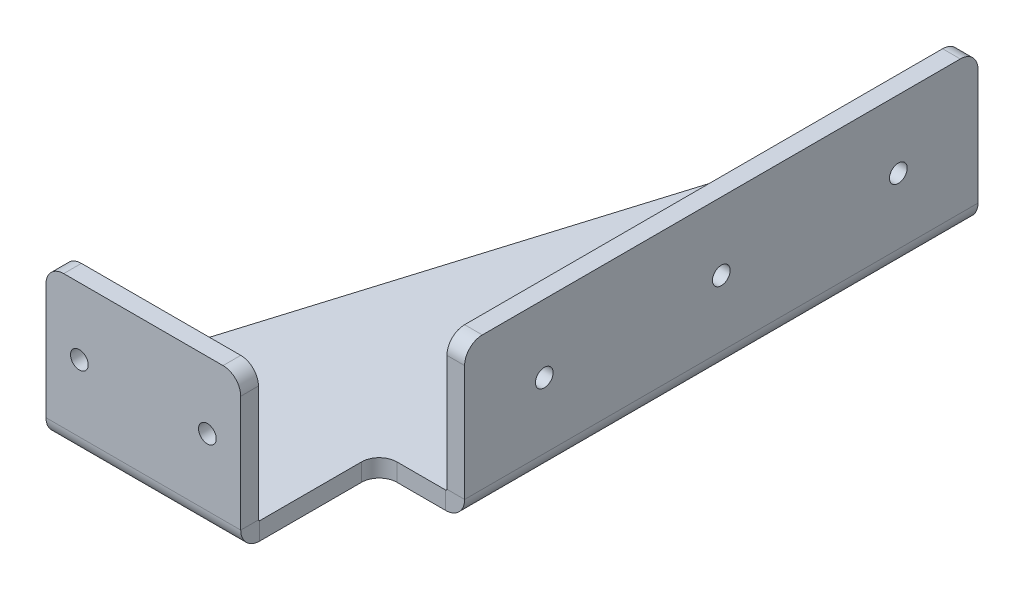
ISO-10303-21;
HEADER;
FILE_DESCRIPTION(('STEP AP214'),'2;1');
FILE_NAME('part.step','',(''),(''),'','','');
FILE_SCHEMA(('AUTOMOTIVE_DESIGN { 1 0 10303 214 1 1 1 1 }'));
ENDSEC;
DATA;
#1=APPLICATION_CONTEXT('core data for automotive mechanical design processes');
#2=APPLICATION_PROTOCOL_DEFINITION('international standard','automotive_design',2000,#1);
#3=PRODUCT_CONTEXT('',#1,'mechanical');
#4=PRODUCT('Part','Part','',(#3));
#5=PRODUCT_RELATED_PRODUCT_CATEGORY('part','',(#4));
#6=PRODUCT_DEFINITION_FORMATION('','',#4);
#7=PRODUCT_DEFINITION_CONTEXT('part definition',#1,'design');
#8=PRODUCT_DEFINITION('design','',#6,#7);
#9=PRODUCT_DEFINITION_SHAPE('','',#8);
#10=(LENGTH_UNIT() NAMED_UNIT(*) SI_UNIT(.MILLI.,.METRE.));
#11=(NAMED_UNIT(*) PLANE_ANGLE_UNIT() SI_UNIT($,.RADIAN.));
#12=(NAMED_UNIT(*) SI_UNIT($,.STERADIAN.) SOLID_ANGLE_UNIT());
#13=UNCERTAINTY_MEASURE_WITH_UNIT(LENGTH_MEASURE(1.E-05),#10,'distance_accuracy_value','');
#14=(GEOMETRIC_REPRESENTATION_CONTEXT(3) GLOBAL_UNCERTAINTY_ASSIGNED_CONTEXT((#13)) GLOBAL_UNIT_ASSIGNED_CONTEXT((#10,
#11,#12)) REPRESENTATION_CONTEXT('',''));
#15=CARTESIAN_POINT('',(0.,0.,0.));
#16=DIRECTION('',(0.,0.,1.));
#17=DIRECTION('',(1.,0.,0.));
#18=AXIS2_PLACEMENT_3D('',#15,#16,#17);
#19=CARTESIAN_POINT('',(0.,-10.,0.));
#20=DIRECTION('',(0.,1.,0.));
#21=DIRECTION('',(0.,0.,1.));
#22=AXIS2_PLACEMENT_3D('',#19,#20,#21);
#23=PLANE('',#22);
#24=DIRECTION('',(-0.29141369364462,0.,0.95659712478995));
#25=VECTOR('',#24,1.);
#26=CARTESIAN_POINT('',(-18.0000000000001,-10.,-310.907216494845));
#27=LINE('',#26,#25);
#28=CARTESIAN_POINT('',(-20.158607290884,-10.,-303.821353431292));
#29=VERTEX_POINT('',#28);
#30=CARTESIAN_POINT('',(-110.,-10.,-8.90721649484535));
#31=VERTEX_POINT('',#30);
#32=EDGE_CURVE('E281',#29,#31,#27,.T.);
#33=ORIENTED_EDGE('',*,*,#32,.F.);
#34=CARTESIAN_POINT('',(-10.5926360429845,-10.,-300.907216494845));
#35=DIRECTION('',(0.,1.,0.));
#36=DIRECTION('',(0.,0.,1.));
#37=AXIS2_PLACEMENT_3D('',#34,#35,#36);
#38=CIRCLE('',#37,10.);
#39=CARTESIAN_POINT('',(-10.5926360429845,-10.,-310.907216494845));
#40=VERTEX_POINT('',#39);
#41=EDGE_CURVE('E371',#29,#40,#38,.F.);
#42=ORIENTED_EDGE('',*,*,#41,.T.);
#43=DIRECTION('',(-1.,0.,0.));
#44=VECTOR('',#43,1.);
#45=CARTESIAN_POINT('',(122.,-10.,-310.907216494845));
#46=LINE('',#45,#44);
#47=CARTESIAN_POINT('',(37.4944848958541,-10.,-310.907216494845));
#48=VERTEX_POINT('',#47);
#49=EDGE_CURVE('E284',#48,#40,#46,.T.);
#50=ORIENTED_EDGE('',*,*,#49,.F.);
#51=DIRECTION('',(0.,0.,1.));
#52=VECTOR('',#51,1.);
#53=CARTESIAN_POINT('',(37.4944848958541,-10.,0.));
#54=LINE('',#53,#52);
#55=CARTESIAN_POINT('',(37.4944848958541,-10.,-20.9072164948453));
#56=VERTEX_POINT('',#55);
#57=EDGE_CURVE('E231',#48,#56,#54,.T.);
#58=ORIENTED_EDGE('',*,*,#57,.T.);
#59=DIRECTION('',(1.,0.,0.));
#60=VECTOR('',#59,1.);
#61=CARTESIAN_POINT('',(0.,-10.,-20.9072164948453));
#62=LINE('',#61,#60);
#63=CARTESIAN_POINT('',(10.,-10.,-20.9072164948453));
#64=VERTEX_POINT('',#63);
#65=EDGE_CURVE('E312',#64,#56,#62,.T.);
#66=ORIENTED_EDGE('',*,*,#65,.F.);
#67=CARTESIAN_POINT('',(10.,-10.,-10.9072164948453));
#68=DIRECTION('',(0.,1.,0.));
#69=DIRECTION('',(0.,0.,1.));
#70=AXIS2_PLACEMENT_3D('',#67,#68,#69);
#71=CIRCLE('',#70,10.);
#72=CARTESIAN_POINT('',(0.,-10.,-10.9072164948453));
#73=VERTEX_POINT('',#72);
#74=EDGE_CURVE('E12',#64,#73,#71,.T.);
#75=ORIENTED_EDGE('',*,*,#74,.T.);
#76=DIRECTION('',(0.,0.,-1.));
#77=VECTOR('',#76,1.);
#78=CARTESIAN_POINT('',(0.,-10.,131.092783505155));
#79=LINE('',#78,#77);
#80=CARTESIAN_POINT('',(0.,-10.,46.5872684010088));
#81=VERTEX_POINT('',#80);
#82=EDGE_CURVE('E306',#81,#73,#79,.T.);
#83=ORIENTED_EDGE('',*,*,#82,.F.);
#84=DIRECTION('',(-1.,0.,0.));
#85=VECTOR('',#84,1.);
#86=CARTESIAN_POINT('',(0.,-10.,46.5872684010088));
#87=LINE('',#86,#85);
#88=CARTESIAN_POINT('',(-110.,-10.,46.5872684010088));
#89=VERTEX_POINT('',#88);
#90=EDGE_CURVE('E292',#81,#89,#87,.T.);
#91=ORIENTED_EDGE('',*,*,#90,.T.);
#92=DIRECTION('',(0.,0.,1.));
#93=VECTOR('',#92,1.);
#94=CARTESIAN_POINT('',(-110.,-10.,-8.90721649484535));
#95=LINE('',#94,#93);
#96=EDGE_CURVE('E283',#31,#89,#95,.T.);
#97=ORIENTED_EDGE('',*,*,#96,.F.);
#98=EDGE_LOOP('',(#33,#42,#50,#58,#66,#75,#83,#91,#97));
#99=FACE_BOUND('',#98,.T.);
#100=ADVANCED_FACE('F50',(#99),#23,.F.);
#101=CARTESIAN_POINT('',(-110.,-10.,-8.90721649484535));
#102=DIRECTION('',(-1.,0.,0.));
#103=DIRECTION('',(0.,0.,1.));
#104=AXIS2_PLACEMENT_3D('',#101,#102,#103);
#105=PLANE('',#104);
#106=DIRECTION('',(0.,-1.,0.));
#107=VECTOR('',#106,1.);
#108=CARTESIAN_POINT('',(-110.,-10.,46.5872684010088));
#109=LINE('',#108,#107);
#110=CARTESIAN_POINT('',(-110.,0.,46.5872684010088));
#111=VERTEX_POINT('',#110);
#112=EDGE_CURVE('E301',#111,#89,#109,.T.);
#113=ORIENTED_EDGE('',*,*,#112,.F.);
#114=DIRECTION('',(0.,0.,1.));
#115=VECTOR('',#114,1.);
#116=CARTESIAN_POINT('',(-110.,0.,-8.90721649484535));
#117=LINE('',#116,#115);
#118=CARTESIAN_POINT('',(-110.,0.,-8.90721649484535));
#119=VERTEX_POINT('',#118);
#120=EDGE_CURVE('E287',#119,#111,#117,.T.);
#121=ORIENTED_EDGE('',*,*,#120,.F.);
#122=DIRECTION('',(0.,1.,0.));
#123=VECTOR('',#122,1.);
#124=CARTESIAN_POINT('',(-110.,-10.,-8.90721649484535));
#125=LINE('',#124,#123);
#126=EDGE_CURVE('E289',#31,#119,#125,.T.);
#127=ORIENTED_EDGE('',*,*,#126,.F.);
#128=ORIENTED_EDGE('',*,*,#96,.T.);
#129=EDGE_LOOP('',(#113,#121,#127,#128));
#130=FACE_BOUND('',#129,.T.);
#131=ADVANCED_FACE('F407',(#130),#105,.T.);
#132=CARTESIAN_POINT('',(-18.0000000000001,-10.,-310.907216494845));
#133=DIRECTION('',(-0.95659712478995,0.,-0.29141369364462));
#134=DIRECTION('',(-0.29141369364462,0.,0.95659712478995));
#135=AXIS2_PLACEMENT_3D('',#132,#133,#134);
#136=PLANE('',#135);
#137=DIRECTION('',(-0.29141369364462,0.,0.95659712478995));
#138=VECTOR('',#137,1.);
#139=CARTESIAN_POINT('',(-18.0000000000001,0.,-310.907216494845));
#140=LINE('',#139,#138);
#141=CARTESIAN_POINT('',(-20.158607290884,0.,-303.821353431292));
#142=VERTEX_POINT('',#141);
#143=EDGE_CURVE('E285',#142,#119,#140,.T.);
#144=ORIENTED_EDGE('',*,*,#143,.F.);
#145=DIRECTION('',(0.,1.,0.));
#146=VECTOR('',#145,1.);
#147=CARTESIAN_POINT('',(-20.158607290884,-10.,-303.821353431292));
#148=LINE('',#147,#146);
#149=EDGE_CURVE('E65',#142,#29,#148,.F.);
#150=ORIENTED_EDGE('',*,*,#149,.T.);
#151=ORIENTED_EDGE('',*,*,#32,.T.);
#152=ORIENTED_EDGE('',*,*,#126,.T.);
#153=EDGE_LOOP('',(#144,#150,#151,#152));
#154=FACE_BOUND('',#153,.T.);
#155=ADVANCED_FACE('F409',(#154),#136,.T.);
#156=CARTESIAN_POINT('',(122.,-10.,-310.907216494845));
#157=DIRECTION('',(0.,0.,-1.));
#158=DIRECTION('',(-1.,0.,0.));
#159=AXIS2_PLACEMENT_3D('',#156,#157,#158);
#160=PLANE('',#159);
#161=ORIENTED_EDGE('',*,*,#49,.T.);
#162=DIRECTION('',(0.,1.,0.));
#163=VECTOR('',#162,1.);
#164=CARTESIAN_POINT('',(-10.5926360429845,-10.,-310.907216494845));
#165=LINE('',#164,#163);
#166=CARTESIAN_POINT('',(-10.5926360429845,0.,-310.907216494845));
#167=VERTEX_POINT('',#166);
#168=EDGE_CURVE('E366',#40,#167,#165,.T.);
#169=ORIENTED_EDGE('',*,*,#168,.T.);
#170=DIRECTION('',(-1.,0.,0.));
#171=VECTOR('',#170,1.);
#172=CARTESIAN_POINT('',(122.,0.,-310.907216494845));
#173=LINE('',#172,#171);
#174=CARTESIAN_POINT('',(37.4944848958541,0.,-310.907216494845));
#175=VERTEX_POINT('',#174);
#176=EDGE_CURVE('E288',#175,#167,#173,.T.);
#177=ORIENTED_EDGE('',*,*,#176,.F.);
#178=DIRECTION('',(0.,1.,0.));
#179=VECTOR('',#178,1.);
#180=CARTESIAN_POINT('',(37.4944848958541,-10.,-310.907216494845));
#181=LINE('',#180,#179);
#182=EDGE_CURVE('E314',#48,#175,#181,.T.);
#183=ORIENTED_EDGE('',*,*,#182,.F.);
#184=EDGE_LOOP('',(#161,#169,#177,#183));
#185=FACE_BOUND('',#184,.T.);
#186=ADVANCED_FACE('F415',(#185),#160,.T.);
#187=CARTESIAN_POINT('',(0.,-10.,-20.9072164948453));
#188=DIRECTION('',(0.,0.,1.));
#189=DIRECTION('',(1.,0.,0.));
#190=AXIS2_PLACEMENT_3D('',#187,#188,#189);
#191=PLANE('',#190);
#192=DIRECTION('',(1.,0.,0.));
#193=VECTOR('',#192,1.);
#194=CARTESIAN_POINT('',(0.,0.,-20.9072164948453));
#195=LINE('',#194,#193);
#196=CARTESIAN_POINT('',(10.,0.,-20.9072164948453));
#197=VERTEX_POINT('',#196);
#198=CARTESIAN_POINT('',(37.4944848958541,0.,-20.9072164948453));
#199=VERTEX_POINT('',#198);
#200=EDGE_CURVE('E309',#197,#199,#195,.T.);
#201=ORIENTED_EDGE('',*,*,#200,.F.);
#202=DIRECTION('',(0.,1.,0.));
#203=VECTOR('',#202,1.);
#204=CARTESIAN_POINT('',(10.,-10.,-20.9072164948453));
#205=LINE('',#204,#203);
#206=EDGE_CURVE('E348',#197,#64,#205,.F.);
#207=ORIENTED_EDGE('',*,*,#206,.T.);
#208=ORIENTED_EDGE('',*,*,#65,.T.);
#209=DIRECTION('',(0.,-1.,0.));
#210=VECTOR('',#209,1.);
#211=CARTESIAN_POINT('',(37.4944848958541,-10.,-20.9072164948453));
#212=LINE('',#211,#210);
#213=EDGE_CURVE('E319',#199,#56,#212,.T.);
#214=ORIENTED_EDGE('',*,*,#213,.F.);
#215=EDGE_LOOP('',(#201,#207,#208,#214));
#216=FACE_BOUND('',#215,.T.);
#217=ADVANCED_FACE('F382',(#216),#191,.T.);
#218=CARTESIAN_POINT('',(0.,-10.,131.092783505155));
#219=DIRECTION('',(1.,0.,0.));
#220=DIRECTION('',(0.,0.,-1.));
#221=AXIS2_PLACEMENT_3D('',#218,#219,#220);
#222=PLANE('',#221);
#223=ORIENTED_EDGE('',*,*,#82,.T.);
#224=DIRECTION('',(0.,1.,0.));
#225=VECTOR('',#224,1.);
#226=CARTESIAN_POINT('',(0.,0.,-10.9072164948453));
#227=LINE('',#226,#225);
#228=CARTESIAN_POINT('',(0.,0.,-10.9072164948453));
#229=VERTEX_POINT('',#228);
#230=EDGE_CURVE('E345',#73,#229,#227,.T.);
#231=ORIENTED_EDGE('',*,*,#230,.T.);
#232=DIRECTION('',(0.,0.,-1.));
#233=VECTOR('',#232,1.);
#234=CARTESIAN_POINT('',(0.,0.,131.092783505155));
#235=LINE('',#234,#233);
#236=CARTESIAN_POINT('',(0.,0.,46.5872684010088));
#237=VERTEX_POINT('',#236);
#238=EDGE_CURVE('E276',#237,#229,#235,.T.);
#239=ORIENTED_EDGE('',*,*,#238,.F.);
#240=DIRECTION('',(0.,1.,0.));
#241=VECTOR('',#240,1.);
#242=CARTESIAN_POINT('',(0.,-10.,46.5872684010088));
#243=LINE('',#242,#241);
#244=EDGE_CURVE('E295',#81,#237,#243,.T.);
#245=ORIENTED_EDGE('',*,*,#244,.F.);
#246=EDGE_LOOP('',(#223,#231,#239,#245));
#247=FACE_BOUND('',#246,.T.);
#248=ADVANCED_FACE('F389',(#247),#222,.T.);
#249=CARTESIAN_POINT('',(0.,0.,0.));
#250=DIRECTION('',(0.,1.,0.));
#251=DIRECTION('',(0.,0.,1.));
#252=AXIS2_PLACEMENT_3D('',#249,#250,#251);
#253=PLANE('',#252);
#254=ORIENTED_EDGE('',*,*,#176,.T.);
#255=CARTESIAN_POINT('',(-10.5926360429845,0.,-300.907216494845));
#256=DIRECTION('',(0.,1.,0.));
#257=DIRECTION('',(0.,0.,1.));
#258=AXIS2_PLACEMENT_3D('',#255,#256,#257);
#259=CIRCLE('',#258,10.);
#260=EDGE_CURVE('E73',#167,#142,#259,.T.);
#261=ORIENTED_EDGE('',*,*,#260,.T.);
#262=ORIENTED_EDGE('',*,*,#143,.T.);
#263=ORIENTED_EDGE('',*,*,#120,.T.);
#264=DIRECTION('',(-1.,0.,0.));
#265=VECTOR('',#264,1.);
#266=CARTESIAN_POINT('',(0.,0.,46.5872684010088));
#267=LINE('',#266,#265);
#268=EDGE_CURVE('E298',#237,#111,#267,.T.);
#269=ORIENTED_EDGE('',*,*,#268,.F.);
#270=ORIENTED_EDGE('',*,*,#238,.T.);
#271=CARTESIAN_POINT('',(10.,0.,-10.9072164948453));
#272=DIRECTION('',(0.,1.,0.));
#273=DIRECTION('',(0.,0.,1.));
#274=AXIS2_PLACEMENT_3D('',#271,#272,#273);
#275=CIRCLE('',#274,10.);
#276=EDGE_CURVE('E58',#229,#197,#275,.F.);
#277=ORIENTED_EDGE('',*,*,#276,.T.);
#278=ORIENTED_EDGE('',*,*,#200,.T.);
#279=DIRECTION('',(0.,0.,1.));
#280=VECTOR('',#279,1.);
#281=CARTESIAN_POINT('',(37.4944848958541,0.,0.));
#282=LINE('',#281,#280);
#283=EDGE_CURVE('E316',#175,#199,#282,.T.);
#284=ORIENTED_EDGE('',*,*,#283,.F.);
#285=EDGE_LOOP('',(#254,#261,#262,#263,#269,#270,#277,#278,#284));
#286=FACE_BOUND('',#285,.T.);
#287=ADVANCED_FACE('F374',(#286),#253,.T.);
#288=CARTESIAN_POINT('',(0.,0.7366,46.5872684010088));
#289=DIRECTION('',(1.,0.,0.));
#290=DIRECTION('',(0.,0.,-1.));
#291=AXIS2_PLACEMENT_3D('',#288,#289,#290);
#292=PLANE('',#291);
#293=ORIENTED_EDGE('',*,*,#244,.T.);
#294=CARTESIAN_POINT('',(0.,0.7366,46.5872684010088));
#295=DIRECTION('',(-1.,0.,0.));
#296=DIRECTION('',(0.,0.,1.));
#297=AXIS2_PLACEMENT_3D('',#294,#295,#296);
#298=CIRCLE('',#297,0.7366);
#299=CARTESIAN_POINT('',(0.,0.736600000000004,47.3238684010088));
#300=VERTEX_POINT('',#299);
#301=EDGE_CURVE('E245',#237,#300,#298,.T.);
#302=ORIENTED_EDGE('',*,*,#301,.T.);
#303=DIRECTION('',(0.,0.,-1.));
#304=VECTOR('',#303,1.);
#305=CARTESIAN_POINT('',(0.,0.736600000000039,57.3238684010088));
#306=LINE('',#305,#304);
#307=CARTESIAN_POINT('',(0.,0.736600000000039,57.3238684010088));
#308=VERTEX_POINT('',#307);
#309=EDGE_CURVE('E259',#308,#300,#306,.T.);
#310=ORIENTED_EDGE('',*,*,#309,.F.);
#311=CARTESIAN_POINT('',(0.,0.7366,46.5872684010088));
#312=DIRECTION('',(-1.,0.,0.));
#313=DIRECTION('',(0.,0.,-1.));
#314=AXIS2_PLACEMENT_3D('',#311,#312,#313);
#315=CIRCLE('',#314,10.7366);
#316=EDGE_CURVE('E269',#81,#308,#315,.T.);
#317=ORIENTED_EDGE('',*,*,#316,.F.);
#318=EDGE_LOOP('',(#293,#302,#310,#317));
#319=FACE_BOUND('',#318,.T.);
#320=ADVANCED_FACE('F395',(#319),#292,.T.);
#321=CARTESIAN_POINT('',(-110.,0.7366,46.5872684010088));
#322=DIRECTION('',(-1.,0.,0.));
#323=DIRECTION('',(0.,0.,1.));
#324=AXIS2_PLACEMENT_3D('',#321,#322,#323);
#325=PLANE('',#324);
#326=DIRECTION('',(0.,0.,1.));
#327=VECTOR('',#326,1.);
#328=CARTESIAN_POINT('',(-110.,0.736600000000039,57.3238684010088));
#329=LINE('',#328,#327);
#330=CARTESIAN_POINT('',(-110.,0.736600000000004,47.3238684010088));
#331=VERTEX_POINT('',#330);
#332=CARTESIAN_POINT('',(-110.,0.736600000000025,57.3238684010088));
#333=VERTEX_POINT('',#332);
#334=EDGE_CURVE('E246',#331,#333,#329,.T.);
#335=ORIENTED_EDGE('',*,*,#334,.F.);
#336=CARTESIAN_POINT('',(-110.,0.7366,46.5872684010088));
#337=DIRECTION('',(-1.,0.,0.));
#338=DIRECTION('',(0.,0.,1.));
#339=AXIS2_PLACEMENT_3D('',#336,#337,#338);
#340=CIRCLE('',#339,0.7366);
#341=EDGE_CURVE('E273',#331,#111,#340,.F.);
#342=ORIENTED_EDGE('',*,*,#341,.T.);
#343=ORIENTED_EDGE('',*,*,#112,.T.);
#344=CARTESIAN_POINT('',(-110.,0.7366,46.5872684010088));
#345=DIRECTION('',(1.,0.,0.));
#346=DIRECTION('',(0.,0.,1.));
#347=AXIS2_PLACEMENT_3D('',#344,#345,#346);
#348=CIRCLE('',#347,10.7366);
#349=EDGE_CURVE('E272',#333,#89,#348,.T.);
#350=ORIENTED_EDGE('',*,*,#349,.F.);
#351=EDGE_LOOP('',(#335,#342,#343,#350));
#352=FACE_BOUND('',#351,.T.);
#353=ADVANCED_FACE('F403',(#352),#325,.T.);
#354=CARTESIAN_POINT('',(55.8205696854819,0.7366,46.5872684010088));
#355=DIRECTION('',(-1.,0.,0.));
#356=DIRECTION('',(0.,0.,1.));
#357=AXIS2_PLACEMENT_3D('',#354,#355,#356);
#358=CYLINDRICAL_SURFACE('',#357,10.7366);
#359=ORIENTED_EDGE('',*,*,#349,.T.);
#360=ORIENTED_EDGE('',*,*,#90,.F.);
#361=ORIENTED_EDGE('',*,*,#316,.T.);
#362=DIRECTION('',(-1.,0.,0.));
#363=VECTOR('',#362,1.);
#364=CARTESIAN_POINT('',(0.,0.736600000000046,57.3238684010088));
#365=LINE('',#364,#363);
#366=EDGE_CURVE('E235',#308,#333,#365,.T.);
#367=ORIENTED_EDGE('',*,*,#366,.T.);
#368=EDGE_LOOP('',(#359,#360,#361,#367));
#369=FACE_BOUND('',#368,.T.);
#370=ADVANCED_FACE('F397',(#369),#358,.T.);
#371=CARTESIAN_POINT('',(55.8205696854819,0.7366,46.5872684010088));
#372=DIRECTION('',(-1.,0.,0.));
#373=DIRECTION('',(0.,0.,1.));
#374=AXIS2_PLACEMENT_3D('',#371,#372,#373);
#375=CYLINDRICAL_SURFACE('',#374,0.7366);
#376=ORIENTED_EDGE('',*,*,#341,.F.);
#377=DIRECTION('',(-1.,0.,0.));
#378=VECTOR('',#377,1.);
#379=CARTESIAN_POINT('',(0.,0.736600000000011,47.3238684010088));
#380=LINE('',#379,#378);
#381=EDGE_CURVE('E254',#300,#331,#380,.T.);
#382=ORIENTED_EDGE('',*,*,#381,.F.);
#383=ORIENTED_EDGE('',*,*,#301,.F.);
#384=ORIENTED_EDGE('',*,*,#268,.T.);
#385=EDGE_LOOP('',(#376,#382,#383,#384));
#386=FACE_BOUND('',#385,.T.);
#387=ADVANCED_FACE('F509',(#386),#375,.F.);
#388=CARTESIAN_POINT('',(-110.,76.2310848958542,57.3238684010086));
#389=DIRECTION('',(0.,1.,0.));
#390=DIRECTION('',(1.,0.,0.));
#391=AXIS2_PLACEMENT_3D('',#388,#389,#390);
#392=PLANE('',#391);
#393=DIRECTION('',(1.,0.,0.));
#394=VECTOR('',#393,1.);
#395=CARTESIAN_POINT('',(-110.,76.2310848958542,47.3238684010086));
#396=LINE('',#395,#394);
#397=CARTESIAN_POINT('',(-100.,76.2310848958542,47.3238684010086));
#398=VERTEX_POINT('',#397);
#399=CARTESIAN_POINT('',(-9.99999999999999,76.2310848958542,47.3238684010086));
#400=VERTEX_POINT('',#399);
#401=EDGE_CURVE('E248',#398,#400,#396,.T.);
#402=ORIENTED_EDGE('',*,*,#401,.F.);
#403=DIRECTION('',(0.,0.,-1.));
#404=VECTOR('',#403,1.);
#405=CARTESIAN_POINT('',(-100.,76.2310848958542,57.3238684010086));
#406=LINE('',#405,#404);
#407=CARTESIAN_POINT('',(-100.,76.2310848958542,57.3238684010086));
#408=VERTEX_POINT('',#407);
#409=EDGE_CURVE('E337',#398,#408,#406,.F.);
#410=ORIENTED_EDGE('',*,*,#409,.T.);
#411=DIRECTION('',(1.,0.,0.));
#412=VECTOR('',#411,1.);
#413=CARTESIAN_POINT('',(-110.,76.2310848958542,57.3238684010086));
#414=LINE('',#413,#412);
#415=CARTESIAN_POINT('',(-9.99999999999999,76.2310848958542,57.3238684010086));
#416=VERTEX_POINT('',#415);
#417=EDGE_CURVE('E264',#408,#416,#414,.T.);
#418=ORIENTED_EDGE('',*,*,#417,.T.);
#419=DIRECTION('',(0.,0.,-1.));
#420=VECTOR('',#419,1.);
#421=CARTESIAN_POINT('',(-9.99999999999999,76.2310848958542,57.3238684010086));
#422=LINE('',#421,#420);
#423=EDGE_CURVE('E334',#416,#400,#422,.T.);
#424=ORIENTED_EDGE('',*,*,#423,.T.);
#425=EDGE_LOOP('',(#402,#410,#418,#424));
#426=FACE_BOUND('',#425,.T.);
#427=ADVANCED_FACE('F496',(#426),#392,.T.);
#428=CARTESIAN_POINT('',(0.,-54.8616986093004,57.323868401009));
#429=DIRECTION('',(0.,0.,-1.));
#430=DIRECTION('',(0.,1.,0.));
#431=AXIS2_PLACEMENT_3D('',#428,#429,#430);
#432=PLANE('',#431);
#433=CARTESIAN_POINT('',(-18.841531010084,38.4838424479271,57.323868401009));
#434=DIRECTION('',(0.,0.,-1.));
#435=DIRECTION('',(0.,1.,0.));
#436=AXIS2_PLACEMENT_3D('',#433,#434,#435);
#437=CIRCLE('',#436,4.99999999999999);
#438=CARTESIAN_POINT('',(-18.841531010084,43.4838424479271,57.3238684010089));
#439=VERTEX_POINT('',#438);
#440=EDGE_CURVE('E468',#439,#439,#437,.T.);
#441=ORIENTED_EDGE('',*,*,#440,.T.);
#442=EDGE_LOOP('',(#441));
#443=FACE_BOUND('',#442,.T.);
#444=CARTESIAN_POINT('',(-91.158468989916,38.4838424479271,57.323868401009));
#445=DIRECTION('',(0.,0.,-1.));
#446=DIRECTION('',(0.,1.,0.));
#447=AXIS2_PLACEMENT_3D('',#444,#445,#446);
#448=CIRCLE('',#447,4.99999999999999);
#449=CARTESIAN_POINT('',(-91.158468989916,43.4838424479271,57.3238684010089));
#450=VERTEX_POINT('',#449);
#451=EDGE_CURVE('E462',#450,#450,#448,.T.);
#452=ORIENTED_EDGE('',*,*,#451,.T.);
#453=EDGE_LOOP('',(#452));
#454=FACE_BOUND('',#453,.T.);
#455=ORIENTED_EDGE('',*,*,#417,.F.);
#456=CARTESIAN_POINT('',(-100.,66.2310848958542,57.3238684010086));
#457=DIRECTION('',(0.,0.,-1.));
#458=DIRECTION('',(0.,1.,0.));
#459=AXIS2_PLACEMENT_3D('',#456,#457,#458);
#460=CIRCLE('',#459,10.);
#461=CARTESIAN_POINT('',(-110.,66.2310848958542,57.3238684010086));
#462=VERTEX_POINT('',#461);
#463=EDGE_CURVE('E341',#408,#462,#460,.F.);
#464=ORIENTED_EDGE('',*,*,#463,.T.);
#465=DIRECTION('',(0.,1.,0.));
#466=VECTOR('',#465,1.);
#467=CARTESIAN_POINT('',(-110.,-63.7689151041458,57.3238684010091));
#468=LINE('',#467,#466);
#469=EDGE_CURVE('E242',#333,#462,#468,.T.);
#470=ORIENTED_EDGE('',*,*,#469,.F.);
#471=ORIENTED_EDGE('',*,*,#366,.F.);
#472=DIRECTION('',(0.,-1.,0.));
#473=VECTOR('',#472,1.);
#474=CARTESIAN_POINT('',(0.,76.2310848958542,57.3238684010086));
#475=LINE('',#474,#473);
#476=CARTESIAN_POINT('',(0.,66.2310848958542,57.3238684010086));
#477=VERTEX_POINT('',#476);
#478=EDGE_CURVE('E262',#477,#308,#475,.T.);
#479=ORIENTED_EDGE('',*,*,#478,.F.);
#480=CARTESIAN_POINT('',(-9.99999999999999,66.2310848958542,57.3238684010086));
#481=DIRECTION('',(0.,0.,-1.));
#482=DIRECTION('',(0.,1.,0.));
#483=AXIS2_PLACEMENT_3D('',#480,#481,#482);
#484=CIRCLE('',#483,10.);
#485=EDGE_CURVE('E339',#477,#416,#484,.F.);
#486=ORIENTED_EDGE('',*,*,#485,.T.);
#487=EDGE_LOOP('',(#455,#464,#470,#471,#479,#486));
#488=FACE_BOUND('',#487,.T.);
#489=ADVANCED_FACE('F499',(#443,#454,#488),#432,.F.);
#490=CARTESIAN_POINT('',(0.,76.2310848958542,57.3238684010086));
#491=DIRECTION('',(1.,0.,0.));
#492=DIRECTION('',(0.,-1.,0.));
#493=AXIS2_PLACEMENT_3D('',#490,#491,#492);
#494=PLANE('',#493);
#495=DIRECTION('',(0.,-1.,0.));
#496=VECTOR('',#495,1.);
#497=CARTESIAN_POINT('',(0.,76.2310848958542,47.3238684010086));
#498=LINE('',#497,#496);
#499=CARTESIAN_POINT('',(0.,66.2310848958542,47.3238684010086));
#500=VERTEX_POINT('',#499);
#501=EDGE_CURVE('E257',#500,#300,#498,.T.);
#502=ORIENTED_EDGE('',*,*,#501,.F.);
#503=DIRECTION('',(0.,0.,-1.));
#504=VECTOR('',#503,1.);
#505=CARTESIAN_POINT('',(0.,66.2310848958542,57.3238684010086));
#506=LINE('',#505,#504);
#507=EDGE_CURVE('E343',#500,#477,#506,.F.);
#508=ORIENTED_EDGE('',*,*,#507,.T.);
#509=ORIENTED_EDGE('',*,*,#478,.T.);
#510=ORIENTED_EDGE('',*,*,#309,.T.);
#511=EDGE_LOOP('',(#502,#508,#509,#510));
#512=FACE_BOUND('',#511,.T.);
#513=ADVANCED_FACE('F481',(#512),#494,.T.);
#514=CARTESIAN_POINT('',(0.,-54.8616986093005,47.323868401009));
#515=DIRECTION('',(0.,0.,-1.));
#516=DIRECTION('',(0.,1.,0.));
#517=AXIS2_PLACEMENT_3D('',#514,#515,#516);
#518=PLANE('',#517);
#519=CARTESIAN_POINT('',(-18.841531010084,38.4838424479271,47.3238684010087));
#520=DIRECTION('',(0.,0.,-1.));
#521=DIRECTION('',(0.,1.,0.));
#522=AXIS2_PLACEMENT_3D('',#519,#520,#521);
#523=CIRCLE('',#522,4.99999999999999);
#524=CARTESIAN_POINT('',(-18.841531010084,43.4838424479271,47.3238684010087));
#525=VERTEX_POINT('',#524);
#526=EDGE_CURVE('E471',#525,#525,#523,.T.);
#527=ORIENTED_EDGE('',*,*,#526,.F.);
#528=EDGE_LOOP('',(#527));
#529=FACE_BOUND('',#528,.T.);
#530=CARTESIAN_POINT('',(-91.158468989916,38.4838424479271,47.3238684010087));
#531=DIRECTION('',(0.,0.,-1.));
#532=DIRECTION('',(0.,1.,0.));
#533=AXIS2_PLACEMENT_3D('',#530,#531,#532);
#534=CIRCLE('',#533,4.99999999999999);
#535=CARTESIAN_POINT('',(-91.158468989916,43.4838424479271,47.3238684010087));
#536=VERTEX_POINT('',#535);
#537=EDGE_CURVE('E465',#536,#536,#534,.T.);
#538=ORIENTED_EDGE('',*,*,#537,.F.);
#539=EDGE_LOOP('',(#538));
#540=FACE_BOUND('',#539,.T.);
#541=DIRECTION('',(0.,1.,0.));
#542=VECTOR('',#541,1.);
#543=CARTESIAN_POINT('',(-110.,-63.7689151041458,47.3238684010091));
#544=LINE('',#543,#542);
#545=CARTESIAN_POINT('',(-110.,66.2310848958542,47.3238684010086));
#546=VERTEX_POINT('',#545);
#547=EDGE_CURVE('E251',#331,#546,#544,.T.);
#548=ORIENTED_EDGE('',*,*,#547,.T.);
#549=CARTESIAN_POINT('',(-100.,66.2310848958542,47.3238684010086));
#550=DIRECTION('',(0.,0.,-1.));
#551=DIRECTION('',(0.,1.,0.));
#552=AXIS2_PLACEMENT_3D('',#549,#550,#551);
#553=CIRCLE('',#552,10.);
#554=EDGE_CURVE('E332',#546,#398,#553,.T.);
#555=ORIENTED_EDGE('',*,*,#554,.T.);
#556=ORIENTED_EDGE('',*,*,#401,.T.);
#557=CARTESIAN_POINT('',(-9.99999999999999,66.2310848958542,47.3238684010086));
#558=DIRECTION('',(0.,0.,-1.));
#559=DIRECTION('',(0.,1.,0.));
#560=AXIS2_PLACEMENT_3D('',#557,#558,#559);
#561=CIRCLE('',#560,10.);
#562=EDGE_CURVE('E330',#400,#500,#561,.T.);
#563=ORIENTED_EDGE('',*,*,#562,.T.);
#564=ORIENTED_EDGE('',*,*,#501,.T.);
#565=ORIENTED_EDGE('',*,*,#381,.T.);
#566=EDGE_LOOP('',(#548,#555,#556,#563,#564,#565));
#567=FACE_BOUND('',#566,.T.);
#568=ADVANCED_FACE('F477',(#529,#540,#567),#518,.T.);
#569=CARTESIAN_POINT('',(-110.,-63.7689151041458,57.3238684010091));
#570=DIRECTION('',(-1.,0.,0.));
#571=DIRECTION('',(0.,1.,0.));
#572=AXIS2_PLACEMENT_3D('',#569,#570,#571);
#573=PLANE('',#572);
#574=ORIENTED_EDGE('',*,*,#469,.T.);
#575=DIRECTION('',(0.,0.,-1.));
#576=VECTOR('',#575,1.);
#577=CARTESIAN_POINT('',(-110.,66.2310848958542,57.3238684010086));
#578=LINE('',#577,#576);
#579=EDGE_CURVE('E322',#462,#546,#578,.T.);
#580=ORIENTED_EDGE('',*,*,#579,.T.);
#581=ORIENTED_EDGE('',*,*,#547,.F.);
#582=ORIENTED_EDGE('',*,*,#334,.T.);
#583=EDGE_LOOP('',(#574,#580,#581,#582));
#584=FACE_BOUND('',#583,.T.);
#585=ADVANCED_FACE('F480',(#584),#573,.T.);
#586=CARTESIAN_POINT('',(37.4944848958541,0.7366,-310.907216494845));
#587=DIRECTION('',(0.,0.,-1.));
#588=DIRECTION('',(-1.,0.,0.));
#589=AXIS2_PLACEMENT_3D('',#586,#587,#588);
#590=PLANE('',#589);
#591=ORIENTED_EDGE('',*,*,#182,.T.);
#592=CARTESIAN_POINT('',(37.4944848958541,0.7366,-310.907216494845));
#593=DIRECTION('',(0.,0.,1.));
#594=DIRECTION('',(1.,0.,0.));
#595=AXIS2_PLACEMENT_3D('',#592,#593,#594);
#596=CIRCLE('',#595,0.7366);
#597=CARTESIAN_POINT('',(38.2310848958541,0.736600000000011,-310.907216494845));
#598=VERTEX_POINT('',#597);
#599=EDGE_CURVE('E226',#175,#598,#596,.T.);
#600=ORIENTED_EDGE('',*,*,#599,.T.);
#601=DIRECTION('',(-1.,0.,0.));
#602=VECTOR('',#601,1.);
#603=CARTESIAN_POINT('',(48.2310848958541,0.736600000000046,-310.907216494845));
#604=LINE('',#603,#602);
#605=CARTESIAN_POINT('',(48.2310848958541,0.736600000000046,-310.907216494845));
#606=VERTEX_POINT('',#605);
#607=EDGE_CURVE('E197',#606,#598,#604,.T.);
#608=ORIENTED_EDGE('',*,*,#607,.F.);
#609=CARTESIAN_POINT('',(37.4944848958541,0.7366,-310.907216494845));
#610=DIRECTION('',(0.,0.,1.));
#611=DIRECTION('',(-1.,0.,0.));
#612=AXIS2_PLACEMENT_3D('',#609,#610,#611);
#613=CIRCLE('',#612,10.7366);
#614=EDGE_CURVE('E223',#48,#606,#613,.T.);
#615=ORIENTED_EDGE('',*,*,#614,.F.);
#616=EDGE_LOOP('',(#591,#600,#608,#615));
#617=FACE_BOUND('',#616,.T.);
#618=ADVANCED_FACE('F222',(#617),#590,.T.);
#619=CARTESIAN_POINT('',(37.4944848958541,0.7366,-20.9072164948453));
#620=DIRECTION('',(0.,0.,1.));
#621=DIRECTION('',(1.,0.,0.));
#622=AXIS2_PLACEMENT_3D('',#619,#620,#621);
#623=PLANE('',#622);
#624=DIRECTION('',(1.,0.,0.));
#625=VECTOR('',#624,1.);
#626=CARTESIAN_POINT('',(48.2310848958541,0.736600000000039,-20.9072164948454));
#627=LINE('',#626,#625);
#628=CARTESIAN_POINT('',(38.2310848958541,0.736600000000004,-20.9072164948454));
#629=VERTEX_POINT('',#628);
#630=CARTESIAN_POINT('',(48.2310848958541,0.736600000000037,-20.9072164948453));
#631=VERTEX_POINT('',#630);
#632=EDGE_CURVE('E441',#629,#631,#627,.T.);
#633=ORIENTED_EDGE('',*,*,#632,.F.);
#634=CARTESIAN_POINT('',(37.4944848958541,0.7366,-20.9072164948453));
#635=DIRECTION('',(0.,0.,1.));
#636=DIRECTION('',(1.,0.,0.));
#637=AXIS2_PLACEMENT_3D('',#634,#635,#636);
#638=CIRCLE('',#637,0.7366);
#639=EDGE_CURVE('E233',#629,#199,#638,.F.);
#640=ORIENTED_EDGE('',*,*,#639,.T.);
#641=ORIENTED_EDGE('',*,*,#213,.T.);
#642=CARTESIAN_POINT('',(37.4944848958541,0.7366,-20.9072164948453));
#643=DIRECTION('',(0.,0.,-1.));
#644=DIRECTION('',(1.,0.,0.));
#645=AXIS2_PLACEMENT_3D('',#642,#643,#644);
#646=CIRCLE('',#645,10.7366);
#647=EDGE_CURVE('E232',#631,#56,#646,.T.);
#648=ORIENTED_EDGE('',*,*,#647,.F.);
#649=EDGE_LOOP('',(#633,#640,#641,#648));
#650=FACE_BOUND('',#649,.T.);
#651=ADVANCED_FACE('F579',(#650),#623,.T.);
#652=CARTESIAN_POINT('',(37.4944848958541,0.7366,-456.219459890495));
#653=DIRECTION('',(0.,0.,1.));
#654=DIRECTION('',(1.,0.,0.));
#655=AXIS2_PLACEMENT_3D('',#652,#653,#654);
#656=CYLINDRICAL_SURFACE('',#655,10.7366);
#657=ORIENTED_EDGE('',*,*,#647,.T.);
#658=ORIENTED_EDGE('',*,*,#57,.F.);
#659=ORIENTED_EDGE('',*,*,#614,.T.);
#660=DIRECTION('',(0.,0.,1.));
#661=VECTOR('',#660,1.);
#662=CARTESIAN_POINT('',(48.2310848958541,0.736600000000039,0.));
#663=LINE('',#662,#661);
#664=EDGE_CURVE('E207',#606,#631,#663,.T.);
#665=ORIENTED_EDGE('',*,*,#664,.T.);
#666=EDGE_LOOP('',(#657,#658,#659,#665));
#667=FACE_BOUND('',#666,.T.);
#668=ADVANCED_FACE('F229',(#667),#656,.T.);
#669=CARTESIAN_POINT('',(37.4944848958541,0.7366,-456.219459890495));
#670=DIRECTION('',(0.,0.,1.));
#671=DIRECTION('',(1.,0.,0.));
#672=AXIS2_PLACEMENT_3D('',#669,#670,#671);
#673=CYLINDRICAL_SURFACE('',#672,0.7366);
#674=ORIENTED_EDGE('',*,*,#639,.F.);
#675=DIRECTION('',(0.,0.,1.));
#676=VECTOR('',#675,1.);
#677=CARTESIAN_POINT('',(38.2310848958541,0.736600000000004,0.));
#678=LINE('',#677,#676);
#679=EDGE_CURVE('E421',#598,#629,#678,.T.);
#680=ORIENTED_EDGE('',*,*,#679,.F.);
#681=ORIENTED_EDGE('',*,*,#599,.F.);
#682=ORIENTED_EDGE('',*,*,#283,.T.);
#683=EDGE_LOOP('',(#674,#680,#681,#682));
#684=FACE_BOUND('',#683,.T.);
#685=ADVANCED_FACE('F419',(#684),#673,.F.);
#686=CARTESIAN_POINT('',(48.2310848958539,76.2310848958542,-20.9072164948454));
#687=DIRECTION('',(0.,1.,0.));
#688=DIRECTION('',(0.,0.,-1.));
#689=AXIS2_PLACEMENT_3D('',#686,#687,#688);
#690=PLANE('',#689);
#691=DIRECTION('',(0.,0.,-1.));
#692=VECTOR('',#691,1.);
#693=CARTESIAN_POINT('',(38.2310848958539,76.2310848958542,-20.9072164948454));
#694=LINE('',#693,#692);
#695=CARTESIAN_POINT('',(38.2310848958539,76.2310848958542,-30.9072164948454));
#696=VERTEX_POINT('',#695);
#697=CARTESIAN_POINT('',(38.2310848958539,76.2310848958542,-300.907216494845));
#698=VERTEX_POINT('',#697);
#699=EDGE_CURVE('E427',#696,#698,#694,.T.);
#700=ORIENTED_EDGE('',*,*,#699,.F.);
#701=DIRECTION('',(-1.,0.,0.));
#702=VECTOR('',#701,1.);
#703=CARTESIAN_POINT('',(48.2310848958539,76.2310848958542,-30.9072164948454));
#704=LINE('',#703,#702);
#705=CARTESIAN_POINT('',(48.2310848958539,76.2310848958542,-30.9072164948454));
#706=VERTEX_POINT('',#705);
#707=EDGE_CURVE('E360',#696,#706,#704,.F.);
#708=ORIENTED_EDGE('',*,*,#707,.T.);
#709=DIRECTION('',(0.,0.,-1.));
#710=VECTOR('',#709,1.);
#711=CARTESIAN_POINT('',(48.2310848958539,76.2310848958542,-20.9072164948454));
#712=LINE('',#711,#710);
#713=CARTESIAN_POINT('',(48.2310848958539,76.2310848958542,-300.907216494845));
#714=VERTEX_POINT('',#713);
#715=EDGE_CURVE('E203',#706,#714,#712,.T.);
#716=ORIENTED_EDGE('',*,*,#715,.T.);
#717=DIRECTION('',(-1.,0.,0.));
#718=VECTOR('',#717,1.);
#719=CARTESIAN_POINT('',(48.2310848958539,76.2310848958542,-300.907216494845));
#720=LINE('',#719,#718);
#721=EDGE_CURVE('E357',#714,#698,#720,.T.);
#722=ORIENTED_EDGE('',*,*,#721,.T.);
#723=EDGE_LOOP('',(#700,#708,#716,#722));
#724=FACE_BOUND('',#723,.T.);
#725=ADVANCED_FACE('F435',(#724),#690,.T.);
#726=CARTESIAN_POINT('',(48.2310848958543,-45.7689151041457,0.));
#727=DIRECTION('',(-1.,0.,0.));
#728=DIRECTION('',(0.,0.,1.));
#729=AXIS2_PLACEMENT_3D('',#726,#727,#728);
#730=PLANE('',#729);
#731=CARTESIAN_POINT('',(48.231084895854,37.8412292181358,-265.907216494845));
#732=DIRECTION('',(-1.,0.,0.));
#733=DIRECTION('',(0.,0.,1.));
#734=AXIS2_PLACEMENT_3D('',#731,#732,#733);
#735=CIRCLE('',#734,5.);
#736=CARTESIAN_POINT('',(48.231084895854,37.8412292181358,-260.907216494845));
#737=VERTEX_POINT('',#736);
#738=EDGE_CURVE('E456',#737,#737,#735,.T.);
#739=ORIENTED_EDGE('',*,*,#738,.T.);
#740=EDGE_LOOP('',(#739));
#741=FACE_BOUND('',#740,.T.);
#742=CARTESIAN_POINT('',(48.231084895854,37.8412292181358,-165.907216494845));
#743=DIRECTION('',(-1.,0.,0.));
#744=DIRECTION('',(0.,0.,1.));
#745=AXIS2_PLACEMENT_3D('',#742,#743,#744);
#746=CIRCLE('',#745,5.);
#747=CARTESIAN_POINT('',(48.231084895854,37.8412292181358,-160.907216494845));
#748=VERTEX_POINT('',#747);
#749=EDGE_CURVE('E450',#748,#748,#746,.T.);
#750=ORIENTED_EDGE('',*,*,#749,.T.);
#751=EDGE_LOOP('',(#750));
#752=FACE_BOUND('',#751,.T.);
#753=CARTESIAN_POINT('',(48.231084895854,37.8412292181358,-65.9072164948454));
#754=DIRECTION('',(-1.,0.,0.));
#755=DIRECTION('',(0.,0.,1.));
#756=AXIS2_PLACEMENT_3D('',#753,#754,#755);
#757=CIRCLE('',#756,5.);
#758=CARTESIAN_POINT('',(48.231084895854,37.8412292181358,-60.9072164948454));
#759=VERTEX_POINT('',#758);
#760=EDGE_CURVE('E216',#759,#759,#757,.T.);
#761=ORIENTED_EDGE('',*,*,#760,.T.);
#762=EDGE_LOOP('',(#761));
#763=FACE_BOUND('',#762,.T.);
#764=ORIENTED_EDGE('',*,*,#715,.F.);
#765=CARTESIAN_POINT('',(48.2310848958539,66.2310848958542,-30.9072164948454));
#766=DIRECTION('',(-1.,0.,0.));
#767=DIRECTION('',(0.,-1.,0.));
#768=AXIS2_PLACEMENT_3D('',#765,#766,#767);
#769=CIRCLE('',#768,10.);
#770=CARTESIAN_POINT('',(48.2310848958539,66.2310848958542,-20.9072164948454));
#771=VERTEX_POINT('',#770);
#772=EDGE_CURVE('E364',#706,#771,#769,.F.);
#773=ORIENTED_EDGE('',*,*,#772,.T.);
#774=DIRECTION('',(0.,1.,0.));
#775=VECTOR('',#774,1.);
#776=CARTESIAN_POINT('',(48.2310848958543,-45.7689151041457,-20.9072164948453));
#777=LINE('',#776,#775);
#778=EDGE_CURVE('E211',#631,#771,#777,.T.);
#779=ORIENTED_EDGE('',*,*,#778,.F.);
#780=ORIENTED_EDGE('',*,*,#664,.F.);
#781=DIRECTION('',(0.,-1.,0.));
#782=VECTOR('',#781,1.);
#783=CARTESIAN_POINT('',(48.2310848958539,76.2310848958542,-310.907216494845));
#784=LINE('',#783,#782);
#785=CARTESIAN_POINT('',(48.2310848958539,66.2310848958542,-310.907216494845));
#786=VERTEX_POINT('',#785);
#787=EDGE_CURVE('E192',#786,#606,#784,.T.);
#788=ORIENTED_EDGE('',*,*,#787,.F.);
#789=CARTESIAN_POINT('',(48.2310848958539,66.2310848958542,-300.907216494845));
#790=DIRECTION('',(-1.,0.,0.));
#791=DIRECTION('',(0.,-1.,0.));
#792=AXIS2_PLACEMENT_3D('',#789,#790,#791);
#793=CIRCLE('',#792,10.);
#794=EDGE_CURVE('E362',#786,#714,#793,.F.);
#795=ORIENTED_EDGE('',*,*,#794,.T.);
#796=EDGE_LOOP('',(#764,#773,#779,#780,#788,#795));
#797=FACE_BOUND('',#796,.T.);
#798=ADVANCED_FACE('F209',(#741,#752,#763,#797),#730,.F.);
#799=CARTESIAN_POINT('',(48.2310848958539,76.2310848958542,-310.907216494845));
#800=DIRECTION('',(0.,0.,-1.));
#801=DIRECTION('',(0.,-1.,0.));
#802=AXIS2_PLACEMENT_3D('',#799,#800,#801);
#803=PLANE('',#802);
#804=DIRECTION('',(0.,-1.,0.));
#805=VECTOR('',#804,1.);
#806=CARTESIAN_POINT('',(38.2310848958539,76.2310848958542,-310.907216494845));
#807=LINE('',#806,#805);
#808=CARTESIAN_POINT('',(38.2310848958539,66.2310848958542,-310.907216494845));
#809=VERTEX_POINT('',#808);
#810=EDGE_CURVE('E227',#809,#598,#807,.T.);
#811=ORIENTED_EDGE('',*,*,#810,.F.);
#812=DIRECTION('',(-1.,0.,0.));
#813=VECTOR('',#812,1.);
#814=CARTESIAN_POINT('',(48.2310848958539,66.2310848958542,-310.907216494845));
#815=LINE('',#814,#813);
#816=EDGE_CURVE('E200',#809,#786,#815,.F.);
#817=ORIENTED_EDGE('',*,*,#816,.T.);
#818=ORIENTED_EDGE('',*,*,#787,.T.);
#819=ORIENTED_EDGE('',*,*,#607,.T.);
#820=EDGE_LOOP('',(#811,#817,#818,#819));
#821=FACE_BOUND('',#820,.T.);
#822=ADVANCED_FACE('F195',(#821),#803,.T.);
#823=CARTESIAN_POINT('',(38.2310848958543,-45.7689151041458,0.));
#824=DIRECTION('',(-1.,0.,0.));
#825=DIRECTION('',(0.,0.,1.));
#826=AXIS2_PLACEMENT_3D('',#823,#824,#825);
#827=PLANE('',#826);
#828=CARTESIAN_POINT('',(38.231084895854,37.8412292181358,-265.907216494845));
#829=DIRECTION('',(-1.,0.,0.));
#830=DIRECTION('',(0.,0.,1.));
#831=AXIS2_PLACEMENT_3D('',#828,#829,#830);
#832=CIRCLE('',#831,5.);
#833=CARTESIAN_POINT('',(38.231084895854,37.8412292181358,-260.907216494845));
#834=VERTEX_POINT('',#833);
#835=EDGE_CURVE('E459',#834,#834,#832,.T.);
#836=ORIENTED_EDGE('',*,*,#835,.F.);
#837=EDGE_LOOP('',(#836));
#838=FACE_BOUND('',#837,.T.);
#839=CARTESIAN_POINT('',(38.231084895854,37.8412292181358,-165.907216494845));
#840=DIRECTION('',(-1.,0.,0.));
#841=DIRECTION('',(0.,0.,1.));
#842=AXIS2_PLACEMENT_3D('',#839,#840,#841);
#843=CIRCLE('',#842,5.);
#844=CARTESIAN_POINT('',(38.231084895854,37.8412292181358,-160.907216494845));
#845=VERTEX_POINT('',#844);
#846=EDGE_CURVE('E453',#845,#845,#843,.T.);
#847=ORIENTED_EDGE('',*,*,#846,.F.);
#848=EDGE_LOOP('',(#847));
#849=FACE_BOUND('',#848,.T.);
#850=CARTESIAN_POINT('',(38.231084895854,37.8412292181358,-65.9072164948454));
#851=DIRECTION('',(-1.,0.,0.));
#852=DIRECTION('',(0.,0.,1.));
#853=AXIS2_PLACEMENT_3D('',#850,#851,#852);
#854=CIRCLE('',#853,5.);
#855=CARTESIAN_POINT('',(38.231084895854,37.8412292181358,-60.9072164948454));
#856=VERTEX_POINT('',#855);
#857=EDGE_CURVE('E447',#856,#856,#854,.T.);
#858=ORIENTED_EDGE('',*,*,#857,.F.);
#859=EDGE_LOOP('',(#858));
#860=FACE_BOUND('',#859,.T.);
#861=DIRECTION('',(0.,1.,0.));
#862=VECTOR('',#861,1.);
#863=CARTESIAN_POINT('',(38.2310848958543,-45.7689151041458,-20.9072164948453));
#864=LINE('',#863,#862);
#865=CARTESIAN_POINT('',(38.2310848958539,66.2310848958542,-20.9072164948454));
#866=VERTEX_POINT('',#865);
#867=EDGE_CURVE('E425',#629,#866,#864,.T.);
#868=ORIENTED_EDGE('',*,*,#867,.T.);
#869=CARTESIAN_POINT('',(38.2310848958539,66.2310848958542,-30.9072164948454));
#870=DIRECTION('',(-1.,0.,0.));
#871=DIRECTION('',(0.,-1.,0.));
#872=AXIS2_PLACEMENT_3D('',#869,#870,#871);
#873=CIRCLE('',#872,10.);
#874=EDGE_CURVE('E355',#866,#696,#873,.T.);
#875=ORIENTED_EDGE('',*,*,#874,.T.);
#876=ORIENTED_EDGE('',*,*,#699,.T.);
#877=CARTESIAN_POINT('',(38.2310848958539,66.2310848958542,-300.907216494845));
#878=DIRECTION('',(-1.,0.,0.));
#879=DIRECTION('',(0.,-1.,0.));
#880=AXIS2_PLACEMENT_3D('',#877,#878,#879);
#881=CIRCLE('',#880,10.);
#882=EDGE_CURVE('E353',#698,#809,#881,.T.);
#883=ORIENTED_EDGE('',*,*,#882,.T.);
#884=ORIENTED_EDGE('',*,*,#810,.T.);
#885=ORIENTED_EDGE('',*,*,#679,.T.);
#886=EDGE_LOOP('',(#868,#875,#876,#883,#884,#885));
#887=FACE_BOUND('',#886,.T.);
#888=ADVANCED_FACE('F440',(#838,#849,#860,#887),#827,.T.);
#889=CARTESIAN_POINT('',(48.2310848958543,-45.7689151041457,-20.9072164948453));
#890=DIRECTION('',(0.,0.,1.));
#891=DIRECTION('',(0.,1.,0.));
#892=AXIS2_PLACEMENT_3D('',#889,#890,#891);
#893=PLANE('',#892);
#894=ORIENTED_EDGE('',*,*,#778,.T.);
#895=DIRECTION('',(-1.,0.,0.));
#896=VECTOR('',#895,1.);
#897=CARTESIAN_POINT('',(48.2310848958539,66.2310848958542,-20.9072164948454));
#898=LINE('',#897,#896);
#899=EDGE_CURVE('E350',#771,#866,#898,.T.);
#900=ORIENTED_EDGE('',*,*,#899,.T.);
#901=ORIENTED_EDGE('',*,*,#867,.F.);
#902=ORIENTED_EDGE('',*,*,#632,.T.);
#903=EDGE_LOOP('',(#894,#900,#901,#902));
#904=FACE_BOUND('',#903,.T.);
#905=ADVANCED_FACE('F535',(#904),#893,.T.);
#906=CARTESIAN_POINT('',(-100.,66.2310848958542,57.3238684010086));
#907=DIRECTION('',(0.,0.,-1.));
#908=DIRECTION('',(0.,1.,0.));
#909=AXIS2_PLACEMENT_3D('',#906,#907,#908);
#910=CYLINDRICAL_SURFACE('',#909,10.);
#911=ORIENTED_EDGE('',*,*,#463,.F.);
#912=ORIENTED_EDGE('',*,*,#409,.F.);
#913=ORIENTED_EDGE('',*,*,#554,.F.);
#914=ORIENTED_EDGE('',*,*,#579,.F.);
#915=EDGE_LOOP('',(#911,#912,#913,#914));
#916=FACE_BOUND('',#915,.T.);
#917=ADVANCED_FACE('F492',(#916),#910,.T.);
#918=CARTESIAN_POINT('',(-9.99999999999999,66.2310848958542,57.3238684010086));
#919=DIRECTION('',(0.,0.,-1.));
#920=DIRECTION('',(0.,1.,0.));
#921=AXIS2_PLACEMENT_3D('',#918,#919,#920);
#922=CYLINDRICAL_SURFACE('',#921,10.);
#923=ORIENTED_EDGE('',*,*,#485,.F.);
#924=ORIENTED_EDGE('',*,*,#507,.F.);
#925=ORIENTED_EDGE('',*,*,#562,.F.);
#926=ORIENTED_EDGE('',*,*,#423,.F.);
#927=EDGE_LOOP('',(#923,#924,#925,#926));
#928=FACE_BOUND('',#927,.T.);
#929=ADVANCED_FACE('F505',(#928),#922,.T.);
#930=CARTESIAN_POINT('',(10.,-10.,-10.9072164948453));
#931=DIRECTION('',(0.,-1.,0.));
#932=DIRECTION('',(0.,0.,-1.));
#933=AXIS2_PLACEMENT_3D('',#930,#931,#932);
#934=CYLINDRICAL_SURFACE('',#933,10.);
#935=ORIENTED_EDGE('',*,*,#74,.F.);
#936=ORIENTED_EDGE('',*,*,#206,.F.);
#937=ORIENTED_EDGE('',*,*,#276,.F.);
#938=ORIENTED_EDGE('',*,*,#230,.F.);
#939=EDGE_LOOP('',(#935,#936,#937,#938));
#940=FACE_BOUND('',#939,.T.);
#941=ADVANCED_FACE('F385',(#940),#934,.F.);
#942=CARTESIAN_POINT('',(48.2310848958539,66.2310848958542,-30.9072164948454));
#943=DIRECTION('',(-1.,0.,0.));
#944=DIRECTION('',(0.,-1.,0.));
#945=AXIS2_PLACEMENT_3D('',#942,#943,#944);
#946=CYLINDRICAL_SURFACE('',#945,10.);
#947=ORIENTED_EDGE('',*,*,#772,.F.);
#948=ORIENTED_EDGE('',*,*,#707,.F.);
#949=ORIENTED_EDGE('',*,*,#874,.F.);
#950=ORIENTED_EDGE('',*,*,#899,.F.);
#951=EDGE_LOOP('',(#947,#948,#949,#950));
#952=FACE_BOUND('',#951,.T.);
#953=ADVANCED_FACE('F540',(#952),#946,.T.);
#954=CARTESIAN_POINT('',(-10.5926360429845,-10.,-300.907216494845));
#955=DIRECTION('',(0.,1.,0.));
#956=DIRECTION('',(0.,0.,1.));
#957=AXIS2_PLACEMENT_3D('',#954,#955,#956);
#958=CYLINDRICAL_SURFACE('',#957,10.);
#959=ORIENTED_EDGE('',*,*,#41,.F.);
#960=ORIENTED_EDGE('',*,*,#149,.F.);
#961=ORIENTED_EDGE('',*,*,#260,.F.);
#962=ORIENTED_EDGE('',*,*,#168,.F.);
#963=EDGE_LOOP('',(#959,#960,#961,#962));
#964=FACE_BOUND('',#963,.T.);
#965=ADVANCED_FACE('F413',(#964),#958,.T.);
#966=CARTESIAN_POINT('',(48.2310848958539,66.2310848958542,-300.907216494845));
#967=DIRECTION('',(-1.,0.,0.));
#968=DIRECTION('',(0.,-1.,0.));
#969=AXIS2_PLACEMENT_3D('',#966,#967,#968);
#970=CYLINDRICAL_SURFACE('',#969,10.);
#971=ORIENTED_EDGE('',*,*,#794,.F.);
#972=ORIENTED_EDGE('',*,*,#816,.F.);
#973=ORIENTED_EDGE('',*,*,#882,.F.);
#974=ORIENTED_EDGE('',*,*,#721,.F.);
#975=EDGE_LOOP('',(#971,#972,#973,#974));
#976=FACE_BOUND('',#975,.T.);
#977=ADVANCED_FACE('F52',(#976),#970,.T.);
#978=CARTESIAN_POINT('',(38.231084895854,37.8412292181358,-65.9072164948454));
#979=DIRECTION('',(-1.,0.,0.));
#980=DIRECTION('',(0.,0.,1.));
#981=AXIS2_PLACEMENT_3D('',#978,#979,#980);
#982=CYLINDRICAL_SURFACE('',#981,5.);
#983=ORIENTED_EDGE('',*,*,#760,.F.);
#984=EDGE_LOOP('',(#983));
#985=FACE_BOUND('',#984,.T.);
#986=ORIENTED_EDGE('',*,*,#857,.T.);
#987=EDGE_LOOP('',(#986));
#988=FACE_BOUND('',#987,.T.);
#989=ADVANCED_FACE('F547',(#985,#988),#982,.F.);
#990=CARTESIAN_POINT('',(38.231084895854,37.8412292181358,-165.907216494845));
#991=DIRECTION('',(-1.,0.,0.));
#992=DIRECTION('',(0.,0.,1.));
#993=AXIS2_PLACEMENT_3D('',#990,#991,#992);
#994=CYLINDRICAL_SURFACE('',#993,5.);
#995=ORIENTED_EDGE('',*,*,#749,.F.);
#996=EDGE_LOOP('',(#995));
#997=FACE_BOUND('',#996,.T.);
#998=ORIENTED_EDGE('',*,*,#846,.T.);
#999=EDGE_LOOP('',(#998));
#1000=FACE_BOUND('',#999,.T.);
#1001=ADVANCED_FACE('F551',(#997,#1000),#994,.F.);
#1002=CARTESIAN_POINT('',(38.231084895854,37.8412292181358,-265.907216494845));
#1003=DIRECTION('',(-1.,0.,0.));
#1004=DIRECTION('',(0.,0.,1.));
#1005=AXIS2_PLACEMENT_3D('',#1002,#1003,#1004);
#1006=CYLINDRICAL_SURFACE('',#1005,5.);
#1007=ORIENTED_EDGE('',*,*,#738,.F.);
#1008=EDGE_LOOP('',(#1007));
#1009=FACE_BOUND('',#1008,.T.);
#1010=ORIENTED_EDGE('',*,*,#835,.T.);
#1011=EDGE_LOOP('',(#1010));
#1012=FACE_BOUND('',#1011,.T.);
#1013=ADVANCED_FACE('F557',(#1009,#1012),#1006,.F.);
#1014=CARTESIAN_POINT('',(-91.158468989916,38.4838424479271,47.3238684010087));
#1015=DIRECTION('',(0.,0.,-1.));
#1016=DIRECTION('',(0.,1.,0.));
#1017=AXIS2_PLACEMENT_3D('',#1014,#1015,#1016);
#1018=CYLINDRICAL_SURFACE('',#1017,4.99999999999999);
#1019=ORIENTED_EDGE('',*,*,#451,.F.);
#1020=EDGE_LOOP('',(#1019));
#1021=FACE_BOUND('',#1020,.T.);
#1022=ORIENTED_EDGE('',*,*,#537,.T.);
#1023=EDGE_LOOP('',(#1022));
#1024=FACE_BOUND('',#1023,.T.);
#1025=ADVANCED_FACE('F687',(#1021,#1024),#1018,.F.);
#1026=CARTESIAN_POINT('',(-18.841531010084,38.4838424479271,47.3238684010087));
#1027=DIRECTION('',(0.,0.,-1.));
#1028=DIRECTION('',(0.,1.,0.));
#1029=AXIS2_PLACEMENT_3D('',#1026,#1027,#1028);
#1030=CYLINDRICAL_SURFACE('',#1029,4.99999999999999);
#1031=ORIENTED_EDGE('',*,*,#440,.F.);
#1032=EDGE_LOOP('',(#1031));
#1033=FACE_BOUND('',#1032,.T.);
#1034=ORIENTED_EDGE('',*,*,#526,.T.);
#1035=EDGE_LOOP('',(#1034));
#1036=FACE_BOUND('',#1035,.T.);
#1037=ADVANCED_FACE('F475',(#1033,#1036),#1030,.F.);
#1038=CLOSED_SHELL('',(#100,#131,#155,#186,#217,#248,#287,#320,#353,#370,#387,#427,#489,#513,
#568,#585,#618,#651,#668,#685,#725,#798,#822,#888,#905,#917,#929,#941,#953,#965,#977,#989,#1001,
#1013,#1025,#1037));
#1039=MANIFOLD_SOLID_BREP('B2',#1038);
#1040=ADVANCED_BREP_SHAPE_REPRESENTATION('',(#18,#1039),#14);
#1041=SHAPE_DEFINITION_REPRESENTATION(#9,#1040);
ENDSEC;
END-ISO-10303-21;
